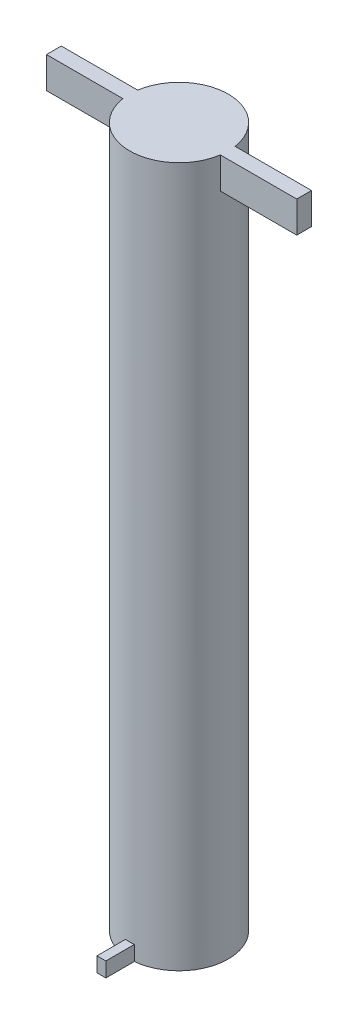
ISO-10303-21;
HEADER;
FILE_DESCRIPTION(('STEP AP214'),'2;1');
FILE_NAME('part.step','',(''),(''),'','','');
FILE_SCHEMA(('AUTOMOTIVE_DESIGN { 1 0 10303 214 1 1 1 1 }'));
ENDSEC;
DATA;
#1=APPLICATION_CONTEXT('core data for automotive mechanical design processes');
#2=APPLICATION_PROTOCOL_DEFINITION('international standard','automotive_design',2000,#1);
#3=PRODUCT_CONTEXT('',#1,'mechanical');
#4=PRODUCT('Part','Part','',(#3));
#5=PRODUCT_RELATED_PRODUCT_CATEGORY('part','',(#4));
#6=PRODUCT_DEFINITION_FORMATION('','',#4);
#7=PRODUCT_DEFINITION_CONTEXT('part definition',#1,'design');
#8=PRODUCT_DEFINITION('design','',#6,#7);
#9=PRODUCT_DEFINITION_SHAPE('','',#8);
#10=(LENGTH_UNIT() NAMED_UNIT(*) SI_UNIT(.MILLI.,.METRE.));
#11=(NAMED_UNIT(*) PLANE_ANGLE_UNIT() SI_UNIT($,.RADIAN.));
#12=(NAMED_UNIT(*) SI_UNIT($,.STERADIAN.) SOLID_ANGLE_UNIT());
#13=UNCERTAINTY_MEASURE_WITH_UNIT(LENGTH_MEASURE(1.E-05),#10,'distance_accuracy_value','');
#14=(GEOMETRIC_REPRESENTATION_CONTEXT(3) GLOBAL_UNCERTAINTY_ASSIGNED_CONTEXT((#13)) GLOBAL_UNIT_ASSIGNED_CONTEXT((#10,
#11,#12)) REPRESENTATION_CONTEXT('',''));
#15=CARTESIAN_POINT('',(0.,0.,0.));
#16=DIRECTION('',(0.,0.,1.));
#17=DIRECTION('',(1.,0.,0.));
#18=AXIS2_PLACEMENT_3D('',#15,#16,#17);
#19=CARTESIAN_POINT('',(0.,142.050008,0.));
#20=DIRECTION('',(0.,-1.,0.));
#21=DIRECTION('',(0.,0.,-1.));
#22=AXIS2_PLACEMENT_3D('',#19,#20,#21);
#23=CYLINDRICAL_SURFACE('',#22,10.);
#24=CARTESIAN_POINT('',(0.,142.050008,0.));
#25=DIRECTION('',(0.,1.,0.));
#26=DIRECTION('',(0.,0.,1.));
#27=AXIS2_PLACEMENT_3D('',#24,#25,#26);
#28=CIRCLE('',#27,10.);
#29=CARTESIAN_POINT('',(9.88685996664259,142.050008,-1.5));
#30=VERTEX_POINT('',#29);
#31=CARTESIAN_POINT('',(-9.88685996664259,142.050008,-1.5));
#32=VERTEX_POINT('',#31);
#33=EDGE_CURVE('E216',#30,#32,#28,.T.);
#34=ORIENTED_EDGE('',*,*,#33,.F.);
#35=DIRECTION('',(0.,-1.,0.));
#36=VECTOR('',#35,1.);
#37=CARTESIAN_POINT('',(9.88685996664259,142.050008,-1.5));
#38=LINE('',#37,#36);
#39=CARTESIAN_POINT('',(9.88685996664259,135.700008,-1.5));
#40=VERTEX_POINT('',#39);
#41=EDGE_CURVE('E184',#30,#40,#38,.T.);
#42=ORIENTED_EDGE('',*,*,#41,.T.);
#43=CARTESIAN_POINT('',(0.,135.700008,0.));
#44=DIRECTION('',(0.,1.,0.));
#45=DIRECTION('',(0.,0.,1.));
#46=AXIS2_PLACEMENT_3D('',#43,#44,#45);
#47=CIRCLE('',#46,10.);
#48=CARTESIAN_POINT('',(9.88685996664259,135.700008,1.5));
#49=VERTEX_POINT('',#48);
#50=EDGE_CURVE('E11',#49,#40,#47,.T.);
#51=ORIENTED_EDGE('',*,*,#50,.F.);
#52=DIRECTION('',(0.,-1.,0.));
#53=VECTOR('',#52,1.);
#54=CARTESIAN_POINT('',(9.88685996664259,142.050008,1.5));
#55=LINE('',#54,#53);
#56=CARTESIAN_POINT('',(9.88685996664259,142.050008,1.5));
#57=VERTEX_POINT('',#56);
#58=EDGE_CURVE('E172',#49,#57,#55,.F.);
#59=ORIENTED_EDGE('',*,*,#58,.T.);
#60=CARTESIAN_POINT('',(-9.88685996664259,142.050008,1.5));
#61=VERTEX_POINT('',#60);
#62=EDGE_CURVE('E214',#61,#57,#28,.T.);
#63=ORIENTED_EDGE('',*,*,#62,.F.);
#64=DIRECTION('',(0.,-1.,0.));
#65=VECTOR('',#64,1.);
#66=CARTESIAN_POINT('',(-9.88685996664259,142.050008,1.5));
#67=LINE('',#66,#65);
#68=CARTESIAN_POINT('',(-9.88685996664259,135.700008,1.5));
#69=VERTEX_POINT('',#68);
#70=EDGE_CURVE('E179',#61,#69,#67,.T.);
#71=ORIENTED_EDGE('',*,*,#70,.T.);
#72=CARTESIAN_POINT('',(-9.88685996664259,135.700008,-1.5));
#73=VERTEX_POINT('',#72);
#74=EDGE_CURVE('E42',#73,#69,#47,.T.);
#75=ORIENTED_EDGE('',*,*,#74,.F.);
#76=DIRECTION('',(0.,-1.,0.));
#77=VECTOR('',#76,1.);
#78=CARTESIAN_POINT('',(-9.88685996664259,142.050008,-1.5));
#79=LINE('',#78,#77);
#80=EDGE_CURVE('E181',#73,#32,#79,.F.);
#81=ORIENTED_EDGE('',*,*,#80,.T.);
#82=EDGE_LOOP('',(#34,#42,#51,#59,#63,#71,#75,#81));
#83=FACE_BOUND('',#82,.T.);
#84=CARTESIAN_POINT('',(0.,0.,0.));
#85=DIRECTION('',(0.,1.,0.));
#86=DIRECTION('',(0.,0.,1.));
#87=AXIS2_PLACEMENT_3D('',#84,#85,#86);
#88=CIRCLE('',#87,10.);
#89=CARTESIAN_POINT('',(0.899999999999999,0.,9.95941765365827));
#90=VERTEX_POINT('',#89);
#91=CARTESIAN_POINT('',(-0.900000000000001,0.,9.95941765365827));
#92=VERTEX_POINT('',#91);
#93=EDGE_CURVE('E213',#90,#92,#88,.T.);
#94=ORIENTED_EDGE('',*,*,#93,.T.);
#95=DIRECTION('',(0.,-1.,0.));
#96=VECTOR('',#95,1.);
#97=CARTESIAN_POINT('',(-0.900000000000001,142.050008,9.95941765365827));
#98=LINE('',#97,#96);
#99=CARTESIAN_POINT('',(-0.900000000000001,3.,9.95941765365827));
#100=VERTEX_POINT('',#99);
#101=EDGE_CURVE('E211',#92,#100,#98,.F.);
#102=ORIENTED_EDGE('',*,*,#101,.T.);
#103=CARTESIAN_POINT('',(0.,3.,0.));
#104=DIRECTION('',(0.,-1.,0.));
#105=DIRECTION('',(0.,0.,-1.));
#106=AXIS2_PLACEMENT_3D('',#103,#104,#105);
#107=CIRCLE('',#106,10.);
#108=CARTESIAN_POINT('',(0.899999999999999,3.,9.95941765365827));
#109=VERTEX_POINT('',#108);
#110=EDGE_CURVE('E217',#109,#100,#107,.T.);
#111=ORIENTED_EDGE('',*,*,#110,.F.);
#112=DIRECTION('',(0.,-1.,0.));
#113=VECTOR('',#112,1.);
#114=CARTESIAN_POINT('',(0.899999999999999,142.050008,9.95941765365827));
#115=LINE('',#114,#113);
#116=EDGE_CURVE('E206',#109,#90,#115,.T.);
#117=ORIENTED_EDGE('',*,*,#116,.T.);
#118=EDGE_LOOP('',(#94,#102,#111,#117));
#119=FACE_BOUND('',#118,.T.);
#120=ADVANCED_FACE('F39',(#83,#119),#23,.T.);
#121=CARTESIAN_POINT('',(0.,142.050008,0.));
#122=DIRECTION('',(0.,1.,0.));
#123=DIRECTION('',(0.,0.,1.));
#124=AXIS2_PLACEMENT_3D('',#121,#122,#123);
#125=PLANE('',#124);
#126=ORIENTED_EDGE('',*,*,#62,.T.);
#127=DIRECTION('',(1.,0.,0.));
#128=VECTOR('',#127,1.);
#129=CARTESIAN_POINT('',(-25.4,142.050008,1.5));
#130=LINE('',#129,#128);
#131=CARTESIAN_POINT('',(25.4,142.050008,1.5));
#132=VERTEX_POINT('',#131);
#133=EDGE_CURVE('E166',#57,#132,#130,.T.);
#134=ORIENTED_EDGE('',*,*,#133,.T.);
#135=DIRECTION('',(0.,0.,-1.));
#136=VECTOR('',#135,1.);
#137=CARTESIAN_POINT('',(25.4,142.050008,-1.5));
#138=LINE('',#137,#136);
#139=CARTESIAN_POINT('',(25.4,142.050008,-1.5));
#140=VERTEX_POINT('',#139);
#141=EDGE_CURVE('E169',#132,#140,#138,.T.);
#142=ORIENTED_EDGE('',*,*,#141,.T.);
#143=DIRECTION('',(-1.,0.,0.));
#144=VECTOR('',#143,1.);
#145=CARTESIAN_POINT('',(-25.4,142.050008,-1.5));
#146=LINE('',#145,#144);
#147=EDGE_CURVE('E60',#140,#30,#146,.T.);
#148=ORIENTED_EDGE('',*,*,#147,.T.);
#149=ORIENTED_EDGE('',*,*,#33,.T.);
#150=CARTESIAN_POINT('',(-25.4,142.050008,-1.5));
#151=VERTEX_POINT('',#150);
#152=EDGE_CURVE('E153',#32,#151,#146,.T.);
#153=ORIENTED_EDGE('',*,*,#152,.T.);
#154=DIRECTION('',(0.,0.,1.));
#155=VECTOR('',#154,1.);
#156=CARTESIAN_POINT('',(-25.4,142.050008,-1.5));
#157=LINE('',#156,#155);
#158=CARTESIAN_POINT('',(-25.4,142.050008,1.5));
#159=VERTEX_POINT('',#158);
#160=EDGE_CURVE('E164',#151,#159,#157,.T.);
#161=ORIENTED_EDGE('',*,*,#160,.T.);
#162=EDGE_CURVE('E53',#159,#61,#130,.T.);
#163=ORIENTED_EDGE('',*,*,#162,.T.);
#164=EDGE_LOOP('',(#126,#134,#142,#148,#149,#153,#161,#163));
#165=FACE_BOUND('',#164,.T.);
#166=ADVANCED_FACE('F223',(#165),#125,.T.);
#167=CARTESIAN_POINT('',(0.,0.,0.));
#168=DIRECTION('',(0.,1.,0.));
#169=DIRECTION('',(0.,0.,1.));
#170=AXIS2_PLACEMENT_3D('',#167,#168,#169);
#171=PLANE('',#170);
#172=CARTESIAN_POINT('',(0.,0.,0.));
#173=DIRECTION('',(0.,-1.,0.));
#174=DIRECTION('',(0.,0.,-1.));
#175=AXIS2_PLACEMENT_3D('',#172,#173,#174);
#176=CIRCLE('',#175,6.);
#177=CARTESIAN_POINT('',(0.,0.,-6.));
#178=VERTEX_POINT('',#177);
#179=EDGE_CURVE('E156',#178,#178,#176,.T.);
#180=ORIENTED_EDGE('',*,*,#179,.F.);
#181=EDGE_LOOP('',(#180));
#182=FACE_BOUND('',#181,.T.);
#183=ORIENTED_EDGE('',*,*,#93,.F.);
#184=DIRECTION('',(0.,0.,1.));
#185=VECTOR('',#184,1.);
#186=CARTESIAN_POINT('',(0.899999999999998,0.,15.75));
#187=LINE('',#186,#185);
#188=CARTESIAN_POINT('',(0.899999999999998,0.,15.75));
#189=VERTEX_POINT('',#188);
#190=EDGE_CURVE('E200',#90,#189,#187,.T.);
#191=ORIENTED_EDGE('',*,*,#190,.T.);
#192=DIRECTION('',(-1.,0.,0.));
#193=VECTOR('',#192,1.);
#194=CARTESIAN_POINT('',(-0.900000000000002,0.,15.75));
#195=LINE('',#194,#193);
#196=CARTESIAN_POINT('',(-0.900000000000002,0.,15.75));
#197=VERTEX_POINT('',#196);
#198=EDGE_CURVE('E192',#189,#197,#195,.T.);
#199=ORIENTED_EDGE('',*,*,#198,.T.);
#200=DIRECTION('',(0.,0.,-1.));
#201=VECTOR('',#200,1.);
#202=CARTESIAN_POINT('',(-0.900000000000002,0.,15.75));
#203=LINE('',#202,#201);
#204=EDGE_CURVE('E187',#197,#92,#203,.T.);
#205=ORIENTED_EDGE('',*,*,#204,.T.);
#206=EDGE_LOOP('',(#183,#191,#199,#205));
#207=FACE_BOUND('',#206,.T.);
#208=ADVANCED_FACE('F248',(#182,#207),#171,.F.);
#209=CARTESIAN_POINT('',(-0.900000000000002,3.,15.75));
#210=DIRECTION('',(-1.,0.,0.));
#211=DIRECTION('',(0.,0.,1.));
#212=AXIS2_PLACEMENT_3D('',#209,#210,#211);
#213=PLANE('',#212);
#214=ORIENTED_EDGE('',*,*,#101,.F.);
#215=ORIENTED_EDGE('',*,*,#204,.F.);
#216=DIRECTION('',(0.,-1.,0.));
#217=VECTOR('',#216,1.);
#218=CARTESIAN_POINT('',(-0.900000000000002,3.,15.75));
#219=LINE('',#218,#217);
#220=CARTESIAN_POINT('',(-0.900000000000002,3.,15.75));
#221=VERTEX_POINT('',#220);
#222=EDGE_CURVE('E204',#221,#197,#219,.T.);
#223=ORIENTED_EDGE('',*,*,#222,.F.);
#224=DIRECTION('',(0.,0.,-1.));
#225=VECTOR('',#224,1.);
#226=CARTESIAN_POINT('',(-0.900000000000002,3.,15.75));
#227=LINE('',#226,#225);
#228=EDGE_CURVE('E188',#221,#100,#227,.T.);
#229=ORIENTED_EDGE('',*,*,#228,.T.);
#230=EDGE_LOOP('',(#214,#215,#223,#229));
#231=FACE_BOUND('',#230,.T.);
#232=ADVANCED_FACE('F253',(#231),#213,.T.);
#233=CARTESIAN_POINT('',(0.899999999999998,3.,15.75));
#234=DIRECTION('',(1.,0.,0.));
#235=DIRECTION('',(0.,0.,-1.));
#236=AXIS2_PLACEMENT_3D('',#233,#234,#235);
#237=PLANE('',#236);
#238=ORIENTED_EDGE('',*,*,#116,.F.);
#239=DIRECTION('',(0.,0.,1.));
#240=VECTOR('',#239,1.);
#241=CARTESIAN_POINT('',(0.899999999999998,3.,15.75));
#242=LINE('',#241,#240);
#243=CARTESIAN_POINT('',(0.899999999999998,3.,15.75));
#244=VERTEX_POINT('',#243);
#245=EDGE_CURVE('E191',#109,#244,#242,.T.);
#246=ORIENTED_EDGE('',*,*,#245,.T.);
#247=DIRECTION('',(0.,-1.,0.));
#248=VECTOR('',#247,1.);
#249=CARTESIAN_POINT('',(0.899999999999998,3.,15.75));
#250=LINE('',#249,#248);
#251=EDGE_CURVE('E197',#244,#189,#250,.T.);
#252=ORIENTED_EDGE('',*,*,#251,.T.);
#253=ORIENTED_EDGE('',*,*,#190,.F.);
#254=EDGE_LOOP('',(#238,#246,#252,#253));
#255=FACE_BOUND('',#254,.T.);
#256=ADVANCED_FACE('F258',(#255),#237,.T.);
#257=CARTESIAN_POINT('',(-0.900000000000002,3.,15.75));
#258=DIRECTION('',(0.,0.,1.));
#259=DIRECTION('',(1.,0.,0.));
#260=AXIS2_PLACEMENT_3D('',#257,#258,#259);
#261=PLANE('',#260);
#262=ORIENTED_EDGE('',*,*,#198,.F.);
#263=ORIENTED_EDGE('',*,*,#251,.F.);
#264=DIRECTION('',(-1.,0.,0.));
#265=VECTOR('',#264,1.);
#266=CARTESIAN_POINT('',(-0.900000000000002,3.,15.75));
#267=LINE('',#266,#265);
#268=EDGE_CURVE('E194',#244,#221,#267,.T.);
#269=ORIENTED_EDGE('',*,*,#268,.T.);
#270=ORIENTED_EDGE('',*,*,#222,.T.);
#271=EDGE_LOOP('',(#262,#263,#269,#270));
#272=FACE_BOUND('',#271,.T.);
#273=ADVANCED_FACE('F262',(#272),#261,.T.);
#274=CARTESIAN_POINT('',(0.,3.,0.));
#275=DIRECTION('',(0.,-1.,0.));
#276=DIRECTION('',(0.,0.,-1.));
#277=AXIS2_PLACEMENT_3D('',#274,#275,#276);
#278=PLANE('',#277);
#279=ORIENTED_EDGE('',*,*,#245,.F.);
#280=ORIENTED_EDGE('',*,*,#110,.T.);
#281=ORIENTED_EDGE('',*,*,#228,.F.);
#282=ORIENTED_EDGE('',*,*,#268,.F.);
#283=EDGE_LOOP('',(#279,#280,#281,#282));
#284=FACE_BOUND('',#283,.T.);
#285=ADVANCED_FACE('F266',(#284),#278,.F.);
#286=CARTESIAN_POINT('',(-25.4,135.700008,-1.5));
#287=DIRECTION('',(-1.,0.,0.));
#288=DIRECTION('',(0.,0.,1.));
#289=AXIS2_PLACEMENT_3D('',#286,#287,#288);
#290=PLANE('',#289);
#291=ORIENTED_EDGE('',*,*,#160,.F.);
#292=DIRECTION('',(0.,1.,0.));
#293=VECTOR('',#292,1.);
#294=CARTESIAN_POINT('',(-25.4,135.700008,-1.5));
#295=LINE('',#294,#293);
#296=CARTESIAN_POINT('',(-25.4,135.700008,-1.5));
#297=VERTEX_POINT('',#296);
#298=EDGE_CURVE('E151',#297,#151,#295,.T.);
#299=ORIENTED_EDGE('',*,*,#298,.F.);
#300=DIRECTION('',(0.,0.,1.));
#301=VECTOR('',#300,1.);
#302=CARTESIAN_POINT('',(-25.4,135.700008,-1.5));
#303=LINE('',#302,#301);
#304=CARTESIAN_POINT('',(-25.4,135.700008,1.5));
#305=VERTEX_POINT('',#304);
#306=EDGE_CURVE('E143',#297,#305,#303,.T.);
#307=ORIENTED_EDGE('',*,*,#306,.T.);
#308=DIRECTION('',(0.,1.,0.));
#309=VECTOR('',#308,1.);
#310=CARTESIAN_POINT('',(-25.4,135.700008,1.5));
#311=LINE('',#310,#309);
#312=EDGE_CURVE('E128',#305,#159,#311,.T.);
#313=ORIENTED_EDGE('',*,*,#312,.T.);
#314=EDGE_LOOP('',(#291,#299,#307,#313));
#315=FACE_BOUND('',#314,.T.);
#316=ADVANCED_FACE('F149',(#315),#290,.T.);
#317=CARTESIAN_POINT('',(0.,135.700008,0.));
#318=DIRECTION('',(0.,1.,0.));
#319=DIRECTION('',(0.,0.,1.));
#320=AXIS2_PLACEMENT_3D('',#317,#318,#319);
#321=PLANE('',#320);
#322=DIRECTION('',(-1.,0.,0.));
#323=VECTOR('',#322,1.);
#324=CARTESIAN_POINT('',(-25.4,135.700008,-1.5));
#325=LINE('',#324,#323);
#326=EDGE_CURVE('E161',#73,#297,#325,.T.);
#327=ORIENTED_EDGE('',*,*,#326,.F.);
#328=ORIENTED_EDGE('',*,*,#74,.T.);
#329=DIRECTION('',(1.,0.,0.));
#330=VECTOR('',#329,1.);
#331=CARTESIAN_POINT('',(-25.4,135.700008,1.5));
#332=LINE('',#331,#330);
#333=EDGE_CURVE('E131',#305,#69,#332,.T.);
#334=ORIENTED_EDGE('',*,*,#333,.F.);
#335=ORIENTED_EDGE('',*,*,#306,.F.);
#336=EDGE_LOOP('',(#327,#328,#334,#335));
#337=FACE_BOUND('',#336,.T.);
#338=ADVANCED_FACE('F142',(#337),#321,.F.);
#339=CARTESIAN_POINT('',(-25.4,135.700008,1.5));
#340=DIRECTION('',(0.,0.,1.));
#341=DIRECTION('',(1.,0.,0.));
#342=AXIS2_PLACEMENT_3D('',#339,#340,#341);
#343=PLANE('',#342);
#344=ORIENTED_EDGE('',*,*,#70,.F.);
#345=ORIENTED_EDGE('',*,*,#162,.F.);
#346=ORIENTED_EDGE('',*,*,#312,.F.);
#347=ORIENTED_EDGE('',*,*,#333,.T.);
#348=EDGE_LOOP('',(#344,#345,#346,#347));
#349=FACE_BOUND('',#348,.T.);
#350=ADVANCED_FACE('F130',(#349),#343,.T.);
#351=CARTESIAN_POINT('',(-25.4,135.700008,-1.5));
#352=DIRECTION('',(0.,0.,-1.));
#353=DIRECTION('',(-1.,0.,0.));
#354=AXIS2_PLACEMENT_3D('',#351,#352,#353);
#355=PLANE('',#354);
#356=ORIENTED_EDGE('',*,*,#80,.F.);
#357=ORIENTED_EDGE('',*,*,#326,.T.);
#358=ORIENTED_EDGE('',*,*,#298,.T.);
#359=ORIENTED_EDGE('',*,*,#152,.F.);
#360=EDGE_LOOP('',(#356,#357,#358,#359));
#361=FACE_BOUND('',#360,.T.);
#362=ADVANCED_FACE('F228',(#361),#355,.T.);
#363=CARTESIAN_POINT('',(25.4,135.700008,1.5));
#364=VERTEX_POINT('',#363);
#365=EDGE_CURVE('E146',#49,#364,#332,.T.);
#366=ORIENTED_EDGE('',*,*,#365,.F.);
#367=ORIENTED_EDGE('',*,*,#50,.T.);
#368=CARTESIAN_POINT('',(25.4,135.700008,-1.5));
#369=VERTEX_POINT('',#368);
#370=EDGE_CURVE('E137',#369,#40,#325,.T.);
#371=ORIENTED_EDGE('',*,*,#370,.F.);
#372=DIRECTION('',(0.,0.,-1.));
#373=VECTOR('',#372,1.);
#374=CARTESIAN_POINT('',(25.4,135.700008,-1.5));
#375=LINE('',#374,#373);
#376=EDGE_CURVE('E145',#364,#369,#375,.T.);
#377=ORIENTED_EDGE('',*,*,#376,.F.);
#378=EDGE_LOOP('',(#366,#367,#371,#377));
#379=FACE_BOUND('',#378,.T.);
#380=ADVANCED_FACE('F230',(#379),#321,.F.);
#381=ORIENTED_EDGE('',*,*,#41,.F.);
#382=ORIENTED_EDGE('',*,*,#147,.F.);
#383=DIRECTION('',(0.,1.,0.));
#384=VECTOR('',#383,1.);
#385=CARTESIAN_POINT('',(25.4,135.700008,-1.5));
#386=LINE('',#385,#384);
#387=EDGE_CURVE('E173',#369,#140,#386,.T.);
#388=ORIENTED_EDGE('',*,*,#387,.F.);
#389=ORIENTED_EDGE('',*,*,#370,.T.);
#390=EDGE_LOOP('',(#381,#382,#388,#389));
#391=FACE_BOUND('',#390,.T.);
#392=ADVANCED_FACE('F232',(#391),#355,.T.);
#393=ORIENTED_EDGE('',*,*,#58,.F.);
#394=ORIENTED_EDGE('',*,*,#365,.T.);
#395=DIRECTION('',(0.,1.,0.));
#396=VECTOR('',#395,1.);
#397=CARTESIAN_POINT('',(25.4,135.700008,1.5));
#398=LINE('',#397,#396);
#399=EDGE_CURVE('E136',#364,#132,#398,.T.);
#400=ORIENTED_EDGE('',*,*,#399,.T.);
#401=ORIENTED_EDGE('',*,*,#133,.F.);
#402=EDGE_LOOP('',(#393,#394,#400,#401));
#403=FACE_BOUND('',#402,.T.);
#404=ADVANCED_FACE('F240',(#403),#343,.T.);
#405=CARTESIAN_POINT('',(25.4,135.700008,-1.5));
#406=DIRECTION('',(1.,0.,0.));
#407=DIRECTION('',(0.,0.,-1.));
#408=AXIS2_PLACEMENT_3D('',#405,#406,#407);
#409=PLANE('',#408);
#410=ORIENTED_EDGE('',*,*,#141,.F.);
#411=ORIENTED_EDGE('',*,*,#399,.F.);
#412=ORIENTED_EDGE('',*,*,#376,.T.);
#413=ORIENTED_EDGE('',*,*,#387,.T.);
#414=EDGE_LOOP('',(#410,#411,#412,#413));
#415=FACE_BOUND('',#414,.T.);
#416=ADVANCED_FACE('F271',(#415),#409,.T.);
#417=CARTESIAN_POINT('',(0.,3.,0.));
#418=DIRECTION('',(0.,-1.,0.));
#419=DIRECTION('',(0.,0.,-1.));
#420=AXIS2_PLACEMENT_3D('',#417,#418,#419);
#421=CYLINDRICAL_SURFACE('',#420,6.);
#422=CARTESIAN_POINT('',(0.,3.,0.));
#423=DIRECTION('',(0.,-1.,0.));
#424=DIRECTION('',(0.,0.,-1.));
#425=AXIS2_PLACEMENT_3D('',#422,#423,#424);
#426=CIRCLE('',#425,6.);
#427=CARTESIAN_POINT('',(0.,3.,-6.));
#428=VERTEX_POINT('',#427);
#429=EDGE_CURVE('E167',#428,#428,#426,.T.);
#430=ORIENTED_EDGE('',*,*,#429,.F.);
#431=EDGE_LOOP('',(#430));
#432=FACE_BOUND('',#431,.T.);
#433=ORIENTED_EDGE('',*,*,#179,.T.);
#434=EDGE_LOOP('',(#433));
#435=FACE_BOUND('',#434,.T.);
#436=ADVANCED_FACE('F273',(#432,#435),#421,.F.);
#437=CARTESIAN_POINT('',(0.,3.,0.));
#438=DIRECTION('',(0.,-1.,0.));
#439=DIRECTION('',(0.,0.,-1.));
#440=AXIS2_PLACEMENT_3D('',#437,#438,#439);
#441=PLANE('',#440);
#442=ORIENTED_EDGE('',*,*,#429,.T.);
#443=EDGE_LOOP('',(#442));
#444=FACE_BOUND('',#443,.T.);
#445=ADVANCED_FACE('F279',(#444),#441,.T.);
#446=CLOSED_SHELL('',(#120,#166,#208,#232,#256,#273,#285,#316,#338,#350,#362,#380,#392,#404,
#416,#436,#445));
#447=MANIFOLD_SOLID_BREP('B2',#446);
#448=ADVANCED_BREP_SHAPE_REPRESENTATION('',(#18,#447),#14);
#449=SHAPE_DEFINITION_REPRESENTATION(#9,#448);
ENDSEC;
END-ISO-10303-21;
